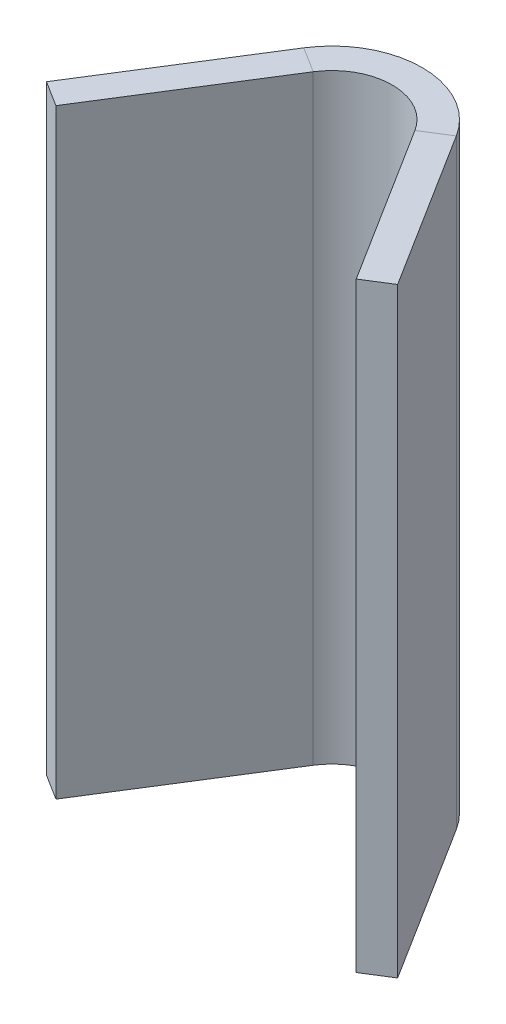
ISO-10303-21;
HEADER;
FILE_DESCRIPTION(('STEP AP214'),'2;1');
FILE_NAME('part.step','',(''),(''),'','','');
FILE_SCHEMA(('AUTOMOTIVE_DESIGN { 1 0 10303 214 1 1 1 1 }'));
ENDSEC;
DATA;
#1=APPLICATION_CONTEXT('core data for automotive mechanical design processes');
#2=APPLICATION_PROTOCOL_DEFINITION('international standard','automotive_design',2000,#1);
#3=PRODUCT_CONTEXT('',#1,'mechanical');
#4=PRODUCT('Part','Part','',(#3));
#5=PRODUCT_RELATED_PRODUCT_CATEGORY('part','',(#4));
#6=PRODUCT_DEFINITION_FORMATION('','',#4);
#7=PRODUCT_DEFINITION_CONTEXT('part definition',#1,'design');
#8=PRODUCT_DEFINITION('design','',#6,#7);
#9=PRODUCT_DEFINITION_SHAPE('','',#8);
#10=(LENGTH_UNIT() NAMED_UNIT(*) SI_UNIT(.MILLI.,.METRE.));
#11=(NAMED_UNIT(*) PLANE_ANGLE_UNIT() SI_UNIT($,.RADIAN.));
#12=(NAMED_UNIT(*) SI_UNIT($,.STERADIAN.) SOLID_ANGLE_UNIT());
#13=UNCERTAINTY_MEASURE_WITH_UNIT(LENGTH_MEASURE(1.E-05),#10,'distance_accuracy_value','');
#14=(GEOMETRIC_REPRESENTATION_CONTEXT(3) GLOBAL_UNCERTAINTY_ASSIGNED_CONTEXT((#13)) GLOBAL_UNIT_ASSIGNED_CONTEXT((#10,
#11,#12)) REPRESENTATION_CONTEXT('',''));
#15=CARTESIAN_POINT('',(0.,0.,0.));
#16=DIRECTION('',(0.,0.,1.));
#17=DIRECTION('',(1.,0.,0.));
#18=AXIS2_PLACEMENT_3D('',#15,#16,#17);
#19=CARTESIAN_POINT('',(5.,0.,-7.95525271793103));
#20=DIRECTION('',(0.,1.,0.));
#21=DIRECTION('',(0.532137630417381,0.,0.84665786613825));
#22=AXIS2_PLACEMENT_3D('',#19,#20,#21);
#23=PLANE('',#22);
#24=DIRECTION('',(-0.84665786613825,0.,0.532137630417381));
#25=VECTOR('',#24,1.);
#26=CARTESIAN_POINT('',(6.6933157322765,0.,-5.26110180162943));
#27=LINE('',#26,#25);
#28=CARTESIAN_POINT('',(7.53997359841475,0.,-5.79323943204681));
#29=VERTEX_POINT('',#28);
#30=CARTESIAN_POINT('',(6.6933157322765,0.,-5.26110180162943));
#31=VERTEX_POINT('',#30);
#32=EDGE_CURVE('E11',#29,#31,#27,.T.);
#33=ORIENTED_EDGE('',*,*,#32,.F.);
#34=DIRECTION('',(-0.532137630417381,0.,-0.84665786613825));
#35=VECTOR('',#34,1.);
#36=CARTESIAN_POINT('',(5.84665786613825,0.,-8.48739034834841));
#37=LINE('',#36,#35);
#38=CARTESIAN_POINT('',(10.8466578661383,0.,-0.532137630417382));
#39=VERTEX_POINT('',#38);
#40=EDGE_CURVE('E93',#29,#39,#37,.F.);
#41=ORIENTED_EDGE('',*,*,#40,.T.);
#42=DIRECTION('',(-0.84665786613825,0.,0.532137630417381));
#43=VECTOR('',#42,1.);
#44=CARTESIAN_POINT('',(10.,0.,0.));
#45=LINE('',#44,#43);
#46=CARTESIAN_POINT('',(10.,0.,0.));
#47=VERTEX_POINT('',#46);
#48=EDGE_CURVE('E53',#39,#47,#45,.T.);
#49=ORIENTED_EDGE('',*,*,#48,.T.);
#50=DIRECTION('',(0.532137630417381,0.,0.84665786613825));
#51=VECTOR('',#50,1.);
#52=CARTESIAN_POINT('',(5.,0.,-7.95525271793103));
#53=LINE('',#52,#51);
#54=EDGE_CURVE('E96',#31,#47,#53,.T.);
#55=ORIENTED_EDGE('',*,*,#54,.F.);
#56=EDGE_LOOP('',(#33,#41,#49,#55));
#57=FACE_BOUND('',#56,.T.);
#58=ADVANCED_FACE('F43',(#57),#23,.F.);
#59=CARTESIAN_POINT('',(10.,20.,0.));
#60=DIRECTION('',(0.532137630417381,0.,0.84665786613825));
#61=DIRECTION('',(0.,-1.,0.));
#62=AXIS2_PLACEMENT_3D('',#59,#60,#61);
#63=PLANE('',#62);
#64=ORIENTED_EDGE('',*,*,#48,.F.);
#65=DIRECTION('',(0.,1.,0.));
#66=VECTOR('',#65,1.);
#67=CARTESIAN_POINT('',(10.8466578661383,20.,-0.532137630417382));
#68=LINE('',#67,#66);
#69=CARTESIAN_POINT('',(10.8466578661383,20.,-0.532137630417382));
#70=VERTEX_POINT('',#69);
#71=EDGE_CURVE('E121',#70,#39,#68,.F.);
#72=ORIENTED_EDGE('',*,*,#71,.F.);
#73=DIRECTION('',(-0.84665786613825,0.,0.532137630417381));
#74=VECTOR('',#73,1.);
#75=CARTESIAN_POINT('',(10.,20.,0.));
#76=LINE('',#75,#74);
#77=CARTESIAN_POINT('',(10.,20.,0.));
#78=VERTEX_POINT('',#77);
#79=EDGE_CURVE('E139',#70,#78,#76,.T.);
#80=ORIENTED_EDGE('',*,*,#79,.T.);
#81=DIRECTION('',(0.,-1.,0.));
#82=VECTOR('',#81,1.);
#83=CARTESIAN_POINT('',(10.,20.,0.));
#84=LINE('',#83,#82);
#85=EDGE_CURVE('E150',#78,#47,#84,.T.);
#86=ORIENTED_EDGE('',*,*,#85,.T.);
#87=EDGE_LOOP('',(#64,#72,#80,#86));
#88=FACE_BOUND('',#87,.T.);
#89=ADVANCED_FACE('F156',(#88),#63,.T.);
#90=CARTESIAN_POINT('',(5.,20.,-7.95525271793103));
#91=DIRECTION('',(0.,1.,0.));
#92=DIRECTION('',(0.532137630417381,0.,0.84665786613825));
#93=AXIS2_PLACEMENT_3D('',#90,#91,#92);
#94=PLANE('',#93);
#95=ORIENTED_EDGE('',*,*,#79,.F.);
#96=DIRECTION('',(-0.532137630417381,0.,-0.84665786613825));
#97=VECTOR('',#96,1.);
#98=CARTESIAN_POINT('',(5.84665786613825,20.,-8.48739034834841));
#99=LINE('',#98,#97);
#100=CARTESIAN_POINT('',(7.53997359841475,20.,-5.79323943204681));
#101=VERTEX_POINT('',#100);
#102=EDGE_CURVE('E181',#101,#70,#99,.F.);
#103=ORIENTED_EDGE('',*,*,#102,.F.);
#104=DIRECTION('',(-0.84665786613825,0.,0.532137630417382));
#105=VECTOR('',#104,1.);
#106=CARTESIAN_POINT('',(6.6933157322765,20.,-5.26110180162943));
#107=LINE('',#106,#105);
#108=CARTESIAN_POINT('',(6.6933157322765,20.,-5.26110180162943));
#109=VERTEX_POINT('',#108);
#110=EDGE_CURVE('E136',#101,#109,#107,.T.);
#111=ORIENTED_EDGE('',*,*,#110,.T.);
#112=DIRECTION('',(0.532137630417381,0.,0.84665786613825));
#113=VECTOR('',#112,1.);
#114=CARTESIAN_POINT('',(5.,20.,-7.95525271793103));
#115=LINE('',#114,#113);
#116=EDGE_CURVE('E157',#109,#78,#115,.T.);
#117=ORIENTED_EDGE('',*,*,#116,.T.);
#118=EDGE_LOOP('',(#95,#103,#111,#117));
#119=FACE_BOUND('',#118,.T.);
#120=ADVANCED_FACE('F187',(#119),#94,.T.);
#121=CARTESIAN_POINT('',(5.,20.,-4.19682654079467));
#122=DIRECTION('',(0.,1.,0.));
#123=DIRECTION('',(0.,0.,1.));
#124=AXIS2_PLACEMENT_3D('',#121,#122,#123);
#125=PLANE('',#124);
#126=ORIENTED_EDGE('',*,*,#110,.F.);
#127=CARTESIAN_POINT('',(5.,20.,-4.19682654079467));
#128=DIRECTION('',(0.,1.,0.));
#129=DIRECTION('',(0.,0.,1.));
#130=AXIS2_PLACEMENT_3D('',#127,#128,#129);
#131=CIRCLE('',#130,3.);
#132=CARTESIAN_POINT('',(2.46002640158525,20.,-5.79323943204681));
#133=VERTEX_POINT('',#132);
#134=EDGE_CURVE('E111',#101,#133,#131,.T.);
#135=ORIENTED_EDGE('',*,*,#134,.T.);
#136=DIRECTION('',(0.84665786613825,0.,0.532137630417381));
#137=VECTOR('',#136,1.);
#138=CARTESIAN_POINT('',(3.3066842677235,20.,-5.26110180162943));
#139=LINE('',#138,#137);
#140=CARTESIAN_POINT('',(3.3066842677235,20.,-5.26110180162943));
#141=VERTEX_POINT('',#140);
#142=EDGE_CURVE('E61',#133,#141,#139,.T.);
#143=ORIENTED_EDGE('',*,*,#142,.T.);
#144=CARTESIAN_POINT('',(5.,20.,-4.19682654079467));
#145=DIRECTION('',(0.,-1.,0.));
#146=DIRECTION('',(0.,0.,-1.));
#147=AXIS2_PLACEMENT_3D('',#144,#145,#146);
#148=CIRCLE('',#147,2.);
#149=EDGE_CURVE('E154',#109,#141,#148,.F.);
#150=ORIENTED_EDGE('',*,*,#149,.F.);
#151=EDGE_LOOP('',(#126,#135,#143,#150));
#152=FACE_BOUND('',#151,.T.);
#153=ADVANCED_FACE('F190',(#152),#125,.T.);
#154=CARTESIAN_POINT('',(0.,20.,0.));
#155=DIRECTION('',(0.,1.,0.));
#156=DIRECTION('',(0.532137630417381,0.,-0.84665786613825));
#157=AXIS2_PLACEMENT_3D('',#154,#155,#156);
#158=PLANE('',#157);
#159=ORIENTED_EDGE('',*,*,#142,.F.);
#160=DIRECTION('',(-0.532137630417381,0.,0.84665786613825));
#161=VECTOR('',#160,1.);
#162=CARTESIAN_POINT('',(-0.84665786613825,20.,-0.532137630417381));
#163=LINE('',#162,#161);
#164=CARTESIAN_POINT('',(-0.84665786613825,20.,-0.532137630417381));
#165=VERTEX_POINT('',#164);
#166=EDGE_CURVE('E180',#165,#133,#163,.F.);
#167=ORIENTED_EDGE('',*,*,#166,.F.);
#168=DIRECTION('',(0.84665786613825,0.,0.532137630417381));
#169=VECTOR('',#168,1.);
#170=CARTESIAN_POINT('',(0.,20.,0.));
#171=LINE('',#170,#169);
#172=CARTESIAN_POINT('',(0.,20.,0.));
#173=VERTEX_POINT('',#172);
#174=EDGE_CURVE('E132',#165,#173,#171,.T.);
#175=ORIENTED_EDGE('',*,*,#174,.T.);
#176=DIRECTION('',(0.532137630417381,0.,-0.84665786613825));
#177=VECTOR('',#176,1.);
#178=CARTESIAN_POINT('',(0.,20.,0.));
#179=LINE('',#178,#177);
#180=EDGE_CURVE('E164',#173,#141,#179,.T.);
#181=ORIENTED_EDGE('',*,*,#180,.T.);
#182=EDGE_LOOP('',(#159,#167,#175,#181));
#183=FACE_BOUND('',#182,.T.);
#184=ADVANCED_FACE('F201',(#183),#158,.T.);
#185=CARTESIAN_POINT('',(0.,20.,0.));
#186=DIRECTION('',(0.532137630417381,0.,-0.84665786613825));
#187=DIRECTION('',(0.,-1.,0.));
#188=AXIS2_PLACEMENT_3D('',#185,#186,#187);
#189=PLANE('',#188);
#190=ORIENTED_EDGE('',*,*,#174,.F.);
#191=DIRECTION('',(0.,1.,0.));
#192=VECTOR('',#191,1.);
#193=CARTESIAN_POINT('',(-0.84665786613825,20.,-0.532137630417381));
#194=LINE('',#193,#192);
#195=CARTESIAN_POINT('',(-0.84665786613825,0.,-0.532137630417381));
#196=VERTEX_POINT('',#195);
#197=EDGE_CURVE('E116',#165,#196,#194,.F.);
#198=ORIENTED_EDGE('',*,*,#197,.T.);
#199=DIRECTION('',(0.84665786613825,0.,0.532137630417381));
#200=VECTOR('',#199,1.);
#201=CARTESIAN_POINT('',(0.,0.,0.));
#202=LINE('',#201,#200);
#203=CARTESIAN_POINT('',(0.,0.,0.));
#204=VERTEX_POINT('',#203);
#205=EDGE_CURVE('E129',#196,#204,#202,.T.);
#206=ORIENTED_EDGE('',*,*,#205,.T.);
#207=DIRECTION('',(0.,-1.,0.));
#208=VECTOR('',#207,1.);
#209=CARTESIAN_POINT('',(0.,20.,0.));
#210=LINE('',#209,#208);
#211=EDGE_CURVE('E167',#173,#204,#210,.T.);
#212=ORIENTED_EDGE('',*,*,#211,.F.);
#213=EDGE_LOOP('',(#190,#198,#206,#212));
#214=FACE_BOUND('',#213,.T.);
#215=ADVANCED_FACE('F207',(#214),#189,.F.);
#216=CARTESIAN_POINT('',(0.,0.,0.));
#217=DIRECTION('',(0.,1.,0.));
#218=DIRECTION('',(0.532137630417381,0.,-0.84665786613825));
#219=AXIS2_PLACEMENT_3D('',#216,#217,#218);
#220=PLANE('',#219);
#221=ORIENTED_EDGE('',*,*,#205,.F.);
#222=DIRECTION('',(-0.532137630417381,0.,0.84665786613825));
#223=VECTOR('',#222,1.);
#224=CARTESIAN_POINT('',(-0.84665786613825,0.,-0.532137630417381));
#225=LINE('',#224,#223);
#226=CARTESIAN_POINT('',(2.46002640158525,0.,-5.79323943204681));
#227=VERTEX_POINT('',#226);
#228=EDGE_CURVE('E178',#196,#227,#225,.F.);
#229=ORIENTED_EDGE('',*,*,#228,.T.);
#230=DIRECTION('',(0.846657866138249,0.,0.532137630417382));
#231=VECTOR('',#230,1.);
#232=CARTESIAN_POINT('',(3.3066842677235,0.,-5.26110180162943));
#233=LINE('',#232,#231);
#234=CARTESIAN_POINT('',(3.3066842677235,0.,-5.26110180162943));
#235=VERTEX_POINT('',#234);
#236=EDGE_CURVE('E47',#227,#235,#233,.T.);
#237=ORIENTED_EDGE('',*,*,#236,.T.);
#238=DIRECTION('',(0.532137630417381,0.,-0.84665786613825));
#239=VECTOR('',#238,1.);
#240=CARTESIAN_POINT('',(0.,0.,0.));
#241=LINE('',#240,#239);
#242=EDGE_CURVE('E159',#204,#235,#241,.T.);
#243=ORIENTED_EDGE('',*,*,#242,.F.);
#244=EDGE_LOOP('',(#221,#229,#237,#243));
#245=FACE_BOUND('',#244,.T.);
#246=ADVANCED_FACE('F211',(#245),#220,.F.);
#247=CARTESIAN_POINT('',(5.,0.,-4.19682654079467));
#248=DIRECTION('',(0.,-1.,0.));
#249=DIRECTION('',(0.,0.,-1.));
#250=AXIS2_PLACEMENT_3D('',#247,#248,#249);
#251=PLANE('',#250);
#252=CARTESIAN_POINT('',(5.,0.,-4.19682654079467));
#253=DIRECTION('',(0.,1.,0.));
#254=DIRECTION('',(0.,0.,1.));
#255=AXIS2_PLACEMENT_3D('',#252,#253,#254);
#256=CIRCLE('',#255,3.);
#257=EDGE_CURVE('E109',#227,#29,#256,.F.);
#258=ORIENTED_EDGE('',*,*,#257,.T.);
#259=ORIENTED_EDGE('',*,*,#32,.T.);
#260=CARTESIAN_POINT('',(5.,0.,-4.19682654079467));
#261=DIRECTION('',(0.,1.,0.));
#262=DIRECTION('',(0.,0.,1.));
#263=AXIS2_PLACEMENT_3D('',#260,#261,#262);
#264=CIRCLE('',#263,2.);
#265=EDGE_CURVE('E174',#235,#31,#264,.F.);
#266=ORIENTED_EDGE('',*,*,#265,.F.);
#267=ORIENTED_EDGE('',*,*,#236,.F.);
#268=EDGE_LOOP('',(#258,#259,#266,#267));
#269=FACE_BOUND('',#268,.T.);
#270=ADVANCED_FACE('F45',(#269),#251,.T.);
#271=CARTESIAN_POINT('',(0.,20.,0.));
#272=DIRECTION('',(-0.84665786613825,0.,-0.532137630417381));
#273=DIRECTION('',(-0.532137630417381,0.,0.84665786613825));
#274=AXIS2_PLACEMENT_3D('',#271,#272,#273);
#275=PLANE('',#274);
#276=ORIENTED_EDGE('',*,*,#242,.T.);
#277=DIRECTION('',(0.,-1.,0.));
#278=VECTOR('',#277,1.);
#279=CARTESIAN_POINT('',(3.3066842677235,20.,-5.26110180162943));
#280=LINE('',#279,#278);
#281=EDGE_CURVE('E171',#235,#141,#280,.F.);
#282=ORIENTED_EDGE('',*,*,#281,.T.);
#283=ORIENTED_EDGE('',*,*,#180,.F.);
#284=ORIENTED_EDGE('',*,*,#211,.T.);
#285=EDGE_LOOP('',(#276,#282,#283,#284));
#286=FACE_BOUND('',#285,.T.);
#287=ADVANCED_FACE('F206',(#286),#275,.F.);
#288=CARTESIAN_POINT('',(5.,20.,-7.95525271793103));
#289=DIRECTION('',(0.84665786613825,0.,-0.532137630417381));
#290=DIRECTION('',(-0.532137630417381,0.,-0.84665786613825));
#291=AXIS2_PLACEMENT_3D('',#288,#289,#290);
#292=PLANE('',#291);
#293=ORIENTED_EDGE('',*,*,#116,.F.);
#294=DIRECTION('',(0.,-1.,0.));
#295=VECTOR('',#294,1.);
#296=CARTESIAN_POINT('',(6.6933157322765,0.,-5.26110180162943));
#297=LINE('',#296,#295);
#298=EDGE_CURVE('E153',#109,#31,#297,.T.);
#299=ORIENTED_EDGE('',*,*,#298,.T.);
#300=ORIENTED_EDGE('',*,*,#54,.T.);
#301=ORIENTED_EDGE('',*,*,#85,.F.);
#302=EDGE_LOOP('',(#293,#299,#300,#301));
#303=FACE_BOUND('',#302,.T.);
#304=ADVANCED_FACE('F149',(#303),#292,.F.);
#305=CARTESIAN_POINT('',(5.,20.,-4.19682654079467));
#306=DIRECTION('',(0.,1.,0.));
#307=DIRECTION('',(0.,0.,1.));
#308=AXIS2_PLACEMENT_3D('',#305,#306,#307);
#309=CYLINDRICAL_SURFACE('',#308,2.);
#310=ORIENTED_EDGE('',*,*,#149,.T.);
#311=ORIENTED_EDGE('',*,*,#281,.F.);
#312=ORIENTED_EDGE('',*,*,#265,.T.);
#313=ORIENTED_EDGE('',*,*,#298,.F.);
#314=EDGE_LOOP('',(#310,#311,#312,#313));
#315=FACE_BOUND('',#314,.T.);
#316=ADVANCED_FACE('F193',(#315),#309,.F.);
#317=CARTESIAN_POINT('',(-0.84665786613825,20.,-0.532137630417381));
#318=DIRECTION('',(-0.84665786613825,0.,-0.532137630417381));
#319=DIRECTION('',(-0.532137630417381,0.,0.84665786613825));
#320=AXIS2_PLACEMENT_3D('',#317,#318,#319);
#321=PLANE('',#320);
#322=ORIENTED_EDGE('',*,*,#228,.F.);
#323=ORIENTED_EDGE('',*,*,#197,.F.);
#324=ORIENTED_EDGE('',*,*,#166,.T.);
#325=DIRECTION('',(0.,1.,0.));
#326=VECTOR('',#325,1.);
#327=CARTESIAN_POINT('',(2.46002640158525,20.,-5.79323943204681));
#328=LINE('',#327,#326);
#329=EDGE_CURVE('E115',#227,#133,#328,.T.);
#330=ORIENTED_EDGE('',*,*,#329,.F.);
#331=EDGE_LOOP('',(#322,#323,#324,#330));
#332=FACE_BOUND('',#331,.T.);
#333=ADVANCED_FACE('F213',(#332),#321,.T.);
#334=CARTESIAN_POINT('',(5.84665786613825,20.,-8.48739034834841));
#335=DIRECTION('',(0.84665786613825,0.,-0.532137630417381));
#336=DIRECTION('',(-0.532137630417381,0.,-0.84665786613825));
#337=AXIS2_PLACEMENT_3D('',#334,#335,#336);
#338=PLANE('',#337);
#339=ORIENTED_EDGE('',*,*,#102,.T.);
#340=ORIENTED_EDGE('',*,*,#71,.T.);
#341=ORIENTED_EDGE('',*,*,#40,.F.);
#342=DIRECTION('',(0.,1.,0.));
#343=VECTOR('',#342,1.);
#344=CARTESIAN_POINT('',(7.53997359841475,20.,-5.79323943204681));
#345=LINE('',#344,#343);
#346=EDGE_CURVE('E106',#101,#29,#345,.F.);
#347=ORIENTED_EDGE('',*,*,#346,.F.);
#348=EDGE_LOOP('',(#339,#340,#341,#347));
#349=FACE_BOUND('',#348,.T.);
#350=ADVANCED_FACE('F119',(#349),#338,.T.);
#351=CARTESIAN_POINT('',(5.,20.,-4.19682654079467));
#352=DIRECTION('',(0.,1.,0.));
#353=DIRECTION('',(0.,0.,1.));
#354=AXIS2_PLACEMENT_3D('',#351,#352,#353);
#355=CYLINDRICAL_SURFACE('',#354,3.);
#356=ORIENTED_EDGE('',*,*,#134,.F.);
#357=ORIENTED_EDGE('',*,*,#346,.T.);
#358=ORIENTED_EDGE('',*,*,#257,.F.);
#359=ORIENTED_EDGE('',*,*,#329,.T.);
#360=EDGE_LOOP('',(#356,#357,#358,#359));
#361=FACE_BOUND('',#360,.T.);
#362=ADVANCED_FACE('F107',(#361),#355,.T.);
#363=CLOSED_SHELL('',(#58,#89,#120,#153,#184,#215,#246,#270,#287,#304,#316,#333,#350,#362));
#364=MANIFOLD_SOLID_BREP('B2',#363);
#365=ADVANCED_BREP_SHAPE_REPRESENTATION('',(#18,#364),#14);
#366=SHAPE_DEFINITION_REPRESENTATION(#9,#365);
ENDSEC;
END-ISO-10303-21;
